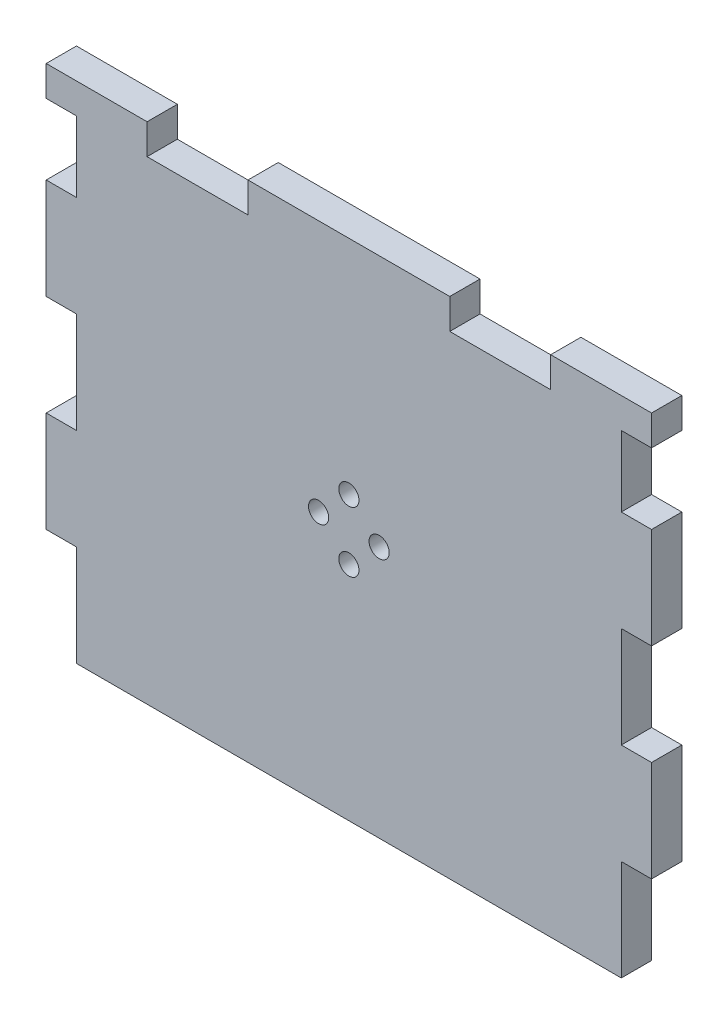
ISO-10303-21;
HEADER;
FILE_DESCRIPTION(('STEP AP214'),'2;1');
FILE_NAME('part.step','',(''),(''),'','','');
FILE_SCHEMA(('AUTOMOTIVE_DESIGN { 1 0 10303 214 1 1 1 1 }'));
ENDSEC;
DATA;
#1=APPLICATION_CONTEXT('core data for automotive mechanical design processes');
#2=APPLICATION_PROTOCOL_DEFINITION('international standard','automotive_design',2000,#1);
#3=PRODUCT_CONTEXT('',#1,'mechanical');
#4=PRODUCT('Part','Part','',(#3));
#5=PRODUCT_RELATED_PRODUCT_CATEGORY('part','',(#4));
#6=PRODUCT_DEFINITION_FORMATION('','',#4);
#7=PRODUCT_DEFINITION_CONTEXT('part definition',#1,'design');
#8=PRODUCT_DEFINITION('design','',#6,#7);
#9=PRODUCT_DEFINITION_SHAPE('','',#8);
#10=(LENGTH_UNIT() NAMED_UNIT(*) SI_UNIT(.MILLI.,.METRE.));
#11=(NAMED_UNIT(*) PLANE_ANGLE_UNIT() SI_UNIT($,.RADIAN.));
#12=(NAMED_UNIT(*) SI_UNIT($,.STERADIAN.) SOLID_ANGLE_UNIT());
#13=UNCERTAINTY_MEASURE_WITH_UNIT(LENGTH_MEASURE(1.E-05),#10,'distance_accuracy_value','');
#14=(GEOMETRIC_REPRESENTATION_CONTEXT(3) GLOBAL_UNCERTAINTY_ASSIGNED_CONTEXT((#13)) GLOBAL_UNIT_ASSIGNED_CONTEXT((#10,
#11,#12)) REPRESENTATION_CONTEXT('',''));
#15=CARTESIAN_POINT('',(0.,0.,0.));
#16=DIRECTION('',(0.,0.,1.));
#17=DIRECTION('',(1.,0.,0.));
#18=AXIS2_PLACEMENT_3D('',#15,#16,#17);
#19=CARTESIAN_POINT('',(-30.,-25.,3.));
#20=DIRECTION('',(0.,1.,0.));
#21=DIRECTION('',(0.,0.,1.));
#22=AXIS2_PLACEMENT_3D('',#19,#20,#21);
#23=PLANE('',#22);
#24=DIRECTION('',(1.,0.,0.));
#25=VECTOR('',#24,1.);
#26=CARTESIAN_POINT('',(-30.,-25.,3.));
#27=LINE('',#26,#25);
#28=CARTESIAN_POINT('',(-26.9999999999999,-25.0000000000002,2.99999999999989));
#29=VERTEX_POINT('',#28);
#30=CARTESIAN_POINT('',(27.0000000000001,-25.,2.99999999999989));
#31=VERTEX_POINT('',#30);
#32=EDGE_CURVE('E257',#29,#31,#27,.T.);
#33=ORIENTED_EDGE('',*,*,#32,.F.);
#34=DIRECTION('',(0.,0.,-1.));
#35=VECTOR('',#34,1.);
#36=CARTESIAN_POINT('',(-26.9999999999999,-25.,-47.0000000000001));
#37=LINE('',#36,#35);
#38=CARTESIAN_POINT('',(-26.9999999999999,-25.0000000000002,9.64506252643105E-13));
#39=VERTEX_POINT('',#38);
#40=EDGE_CURVE('E246',#29,#39,#37,.T.);
#41=ORIENTED_EDGE('',*,*,#40,.T.);
#42=DIRECTION('',(1.,0.,0.));
#43=VECTOR('',#42,1.);
#44=CARTESIAN_POINT('',(-30.,-25.,0.));
#45=LINE('',#44,#43);
#46=CARTESIAN_POINT('',(26.9999999999997,-25.,9.64506252643105E-13));
#47=VERTEX_POINT('',#46);
#48=EDGE_CURVE('E255',#39,#47,#45,.T.);
#49=ORIENTED_EDGE('',*,*,#48,.T.);
#50=DIRECTION('',(0.,0.,-1.));
#51=VECTOR('',#50,1.);
#52=CARTESIAN_POINT('',(27.0000000000001,-24.9999999999999,-47.0000000000001));
#53=LINE('',#52,#51);
#54=EDGE_CURVE('E372',#31,#47,#53,.T.);
#55=ORIENTED_EDGE('',*,*,#54,.F.);
#56=EDGE_LOOP('',(#33,#41,#49,#55));
#57=FACE_BOUND('',#56,.T.);
#58=ADVANCED_FACE('F37',(#57),#23,.F.);
#59=CARTESIAN_POINT('',(30.,-25.,3.));
#60=DIRECTION('',(-1.,0.,0.));
#61=DIRECTION('',(0.,0.,1.));
#62=AXIS2_PLACEMENT_3D('',#59,#60,#61);
#63=PLANE('',#62);
#64=DIRECTION('',(0.,1.,0.));
#65=VECTOR('',#64,1.);
#66=CARTESIAN_POINT('',(30.,-25.,3.));
#67=LINE('',#66,#65);
#68=CARTESIAN_POINT('',(29.9999999999999,22.,3.00000000000005));
#69=VERTEX_POINT('',#68);
#70=CARTESIAN_POINT('',(30.,25.,3.));
#71=VERTEX_POINT('',#70);
#72=EDGE_CURVE('E265',#69,#71,#67,.T.);
#73=ORIENTED_EDGE('',*,*,#72,.F.);
#74=DIRECTION('',(0.,0.,-1.));
#75=VECTOR('',#74,1.);
#76=CARTESIAN_POINT('',(29.9999999999999,22.,3.00000000000005));
#77=LINE('',#76,#75);
#78=CARTESIAN_POINT('',(29.9999999999999,22.,0.));
#79=VERTEX_POINT('',#78);
#80=EDGE_CURVE('E345',#69,#79,#77,.T.);
#81=ORIENTED_EDGE('',*,*,#80,.T.);
#82=DIRECTION('',(0.,1.,0.));
#83=VECTOR('',#82,1.);
#84=CARTESIAN_POINT('',(30.,-25.,0.));
#85=LINE('',#84,#83);
#86=CARTESIAN_POINT('',(30.,25.,0.));
#87=VERTEX_POINT('',#86);
#88=EDGE_CURVE('E406',#79,#87,#85,.T.);
#89=ORIENTED_EDGE('',*,*,#88,.T.);
#90=DIRECTION('',(0.,0.,-1.));
#91=VECTOR('',#90,1.);
#92=CARTESIAN_POINT('',(30.,25.,3.));
#93=LINE('',#92,#91);
#94=EDGE_CURVE('E280',#71,#87,#93,.T.);
#95=ORIENTED_EDGE('',*,*,#94,.F.);
#96=EDGE_LOOP('',(#73,#81,#89,#95));
#97=FACE_BOUND('',#96,.T.);
#98=ADVANCED_FACE('F491',(#97),#63,.F.);
#99=CARTESIAN_POINT('',(30.,4.99999999999999,0.));
#100=VERTEX_POINT('',#99);
#101=CARTESIAN_POINT('',(30.,15.,0.));
#102=VERTEX_POINT('',#101);
#103=EDGE_CURVE('E333',#100,#102,#85,.T.);
#104=ORIENTED_EDGE('',*,*,#103,.T.);
#105=DIRECTION('',(0.,0.,1.));
#106=VECTOR('',#105,1.);
#107=CARTESIAN_POINT('',(30.,15.,3.00000000000003));
#108=LINE('',#107,#106);
#109=CARTESIAN_POINT('',(30.,15.,3.00000000000003));
#110=VERTEX_POINT('',#109);
#111=EDGE_CURVE('E327',#102,#110,#108,.T.);
#112=ORIENTED_EDGE('',*,*,#111,.T.);
#113=CARTESIAN_POINT('',(30.,4.99999999999998,2.99999999999999));
#114=VERTEX_POINT('',#113);
#115=EDGE_CURVE('E268',#114,#110,#67,.T.);
#116=ORIENTED_EDGE('',*,*,#115,.F.);
#117=DIRECTION('',(0.,0.,-1.));
#118=VECTOR('',#117,1.);
#119=CARTESIAN_POINT('',(30.,4.99999999999998,2.99999999999999));
#120=LINE('',#119,#118);
#121=EDGE_CURVE('E348',#114,#100,#120,.T.);
#122=ORIENTED_EDGE('',*,*,#121,.T.);
#123=EDGE_LOOP('',(#104,#112,#116,#122));
#124=FACE_BOUND('',#123,.T.);
#125=ADVANCED_FACE('F465',(#124),#63,.F.);
#126=CARTESIAN_POINT('',(-30.,-25.,3.));
#127=DIRECTION('',(1.,0.,0.));
#128=DIRECTION('',(0.,0.,-1.));
#129=AXIS2_PLACEMENT_3D('',#126,#127,#128);
#130=PLANE('',#129);
#131=DIRECTION('',(0.,0.,-1.));
#132=VECTOR('',#131,1.);
#133=CARTESIAN_POINT('',(-29.9999999999999,-15.0000000000002,2.99999999999993));
#134=LINE('',#133,#132);
#135=CARTESIAN_POINT('',(-29.9999999999999,-15.0000000000002,2.99999999999993));
#136=VERTEX_POINT('',#135);
#137=CARTESIAN_POINT('',(-29.9999999999999,-15.0000000000002,0.));
#138=VERTEX_POINT('',#137);
#139=EDGE_CURVE('E512',#136,#138,#134,.T.);
#140=ORIENTED_EDGE('',*,*,#139,.F.);
#141=DIRECTION('',(0.,-1.,0.));
#142=VECTOR('',#141,1.);
#143=CARTESIAN_POINT('',(-30.,-25.,3.));
#144=LINE('',#143,#142);
#145=CARTESIAN_POINT('',(-30.,-5.00000000000023,2.99999999999996));
#146=VERTEX_POINT('',#145);
#147=EDGE_CURVE('E440',#146,#136,#144,.T.);
#148=ORIENTED_EDGE('',*,*,#147,.F.);
#149=DIRECTION('',(0.,0.,1.));
#150=VECTOR('',#149,1.);
#151=CARTESIAN_POINT('',(-30.,-5.00000000000023,2.99999999999996));
#152=LINE('',#151,#150);
#153=CARTESIAN_POINT('',(-30.,-5.00000000000022,0.));
#154=VERTEX_POINT('',#153);
#155=EDGE_CURVE('E503',#154,#146,#152,.T.);
#156=ORIENTED_EDGE('',*,*,#155,.F.);
#157=DIRECTION('',(0.,-1.,0.));
#158=VECTOR('',#157,1.);
#159=CARTESIAN_POINT('',(-30.,-25.,0.));
#160=LINE('',#159,#158);
#161=EDGE_CURVE('E274',#154,#138,#160,.T.);
#162=ORIENTED_EDGE('',*,*,#161,.T.);
#163=EDGE_LOOP('',(#140,#148,#156,#162));
#164=FACE_BOUND('',#163,.T.);
#165=ADVANCED_FACE('F571',(#164),#130,.F.);
#166=DIRECTION('',(0.,0.,-1.));
#167=VECTOR('',#166,1.);
#168=CARTESIAN_POINT('',(-30.,4.99999999999977,2.99999999999999));
#169=LINE('',#168,#167);
#170=CARTESIAN_POINT('',(-30.,4.99999999999977,2.99999999999999));
#171=VERTEX_POINT('',#170);
#172=CARTESIAN_POINT('',(-30.,4.99999999999978,0.));
#173=VERTEX_POINT('',#172);
#174=EDGE_CURVE('E516',#171,#173,#169,.T.);
#175=ORIENTED_EDGE('',*,*,#174,.F.);
#176=CARTESIAN_POINT('',(-30.,14.9999999999998,3.00000000000003));
#177=VERTEX_POINT('',#176);
#178=EDGE_CURVE('E446',#177,#171,#144,.T.);
#179=ORIENTED_EDGE('',*,*,#178,.F.);
#180=DIRECTION('',(0.,0.,1.));
#181=VECTOR('',#180,1.);
#182=CARTESIAN_POINT('',(-30.,14.9999999999998,3.00000000000003));
#183=LINE('',#182,#181);
#184=CARTESIAN_POINT('',(-30.,14.9999999999998,0.));
#185=VERTEX_POINT('',#184);
#186=EDGE_CURVE('E519',#185,#177,#183,.T.);
#187=ORIENTED_EDGE('',*,*,#186,.F.);
#188=EDGE_CURVE('E272',#185,#173,#160,.T.);
#189=ORIENTED_EDGE('',*,*,#188,.T.);
#190=EDGE_LOOP('',(#175,#179,#187,#189));
#191=FACE_BOUND('',#190,.T.);
#192=ADVANCED_FACE('F588',(#191),#130,.F.);
#193=DIRECTION('',(0.,0.,-1.));
#194=VECTOR('',#193,1.);
#195=CARTESIAN_POINT('',(-30.,21.9999999999998,3.00000000000005));
#196=LINE('',#195,#194);
#197=CARTESIAN_POINT('',(-30.,21.9999999999998,3.00000000000005));
#198=VERTEX_POINT('',#197);
#199=CARTESIAN_POINT('',(-30.,21.9999999999998,0.));
#200=VERTEX_POINT('',#199);
#201=EDGE_CURVE('E535',#198,#200,#196,.T.);
#202=ORIENTED_EDGE('',*,*,#201,.F.);
#203=CARTESIAN_POINT('',(-30.,25.,3.));
#204=VERTEX_POINT('',#203);
#205=EDGE_CURVE('E443',#204,#198,#144,.T.);
#206=ORIENTED_EDGE('',*,*,#205,.F.);
#207=DIRECTION('',(0.,0.,-1.));
#208=VECTOR('',#207,1.);
#209=CARTESIAN_POINT('',(-30.,25.,3.));
#210=LINE('',#209,#208);
#211=CARTESIAN_POINT('',(-30.,25.,0.));
#212=VERTEX_POINT('',#211);
#213=EDGE_CURVE('E277',#204,#212,#210,.T.);
#214=ORIENTED_EDGE('',*,*,#213,.T.);
#215=EDGE_CURVE('E266',#212,#200,#160,.T.);
#216=ORIENTED_EDGE('',*,*,#215,.T.);
#217=EDGE_LOOP('',(#202,#206,#214,#216));
#218=FACE_BOUND('',#217,.T.);
#219=ADVANCED_FACE('F548',(#218),#130,.F.);
#220=CARTESIAN_POINT('',(0.,0.,0.));
#221=DIRECTION('',(0.,0.,-1.));
#222=DIRECTION('',(-1.,0.,0.));
#223=AXIS2_PLACEMENT_3D('',#220,#221,#222);
#224=PLANE('',#223);
#225=CARTESIAN_POINT('',(0.,3.,0.));
#226=DIRECTION('',(0.,0.,-1.));
#227=DIRECTION('',(-1.,0.,0.));
#228=AXIS2_PLACEMENT_3D('',#225,#226,#227);
#229=CIRCLE('',#228,1.);
#230=CARTESIAN_POINT('',(-1.,3.,0.));
#231=VERTEX_POINT('',#230);
#232=EDGE_CURVE('E294',#231,#231,#229,.T.);
#233=ORIENTED_EDGE('',*,*,#232,.F.);
#234=EDGE_LOOP('',(#233));
#235=FACE_BOUND('',#234,.T.);
#236=CARTESIAN_POINT('',(3.00000000000008,0.,0.));
#237=DIRECTION('',(0.,0.,-1.));
#238=DIRECTION('',(-1.,0.,0.));
#239=AXIS2_PLACEMENT_3D('',#236,#237,#238);
#240=CIRCLE('',#239,1.00000000000007);
#241=CARTESIAN_POINT('',(2.00000000000002,0.,0.));
#242=VERTEX_POINT('',#241);
#243=EDGE_CURVE('E291',#242,#242,#240,.T.);
#244=ORIENTED_EDGE('',*,*,#243,.F.);
#245=EDGE_LOOP('',(#244));
#246=FACE_BOUND('',#245,.T.);
#247=CARTESIAN_POINT('',(1.69428074463191E-13,-3.,0.));
#248=DIRECTION('',(0.,0.,-1.));
#249=DIRECTION('',(-1.,0.,0.));
#250=AXIS2_PLACEMENT_3D('',#247,#248,#249);
#251=CIRCLE('',#250,1.00000000000018);
#252=CARTESIAN_POINT('',(-1.00000000000001,-3.,0.));
#253=VERTEX_POINT('',#252);
#254=EDGE_CURVE('E287',#253,#253,#251,.T.);
#255=ORIENTED_EDGE('',*,*,#254,.F.);
#256=EDGE_LOOP('',(#255));
#257=FACE_BOUND('',#256,.T.);
#258=CARTESIAN_POINT('',(-2.99999999999992,0.,0.));
#259=DIRECTION('',(0.,0.,-1.));
#260=DIRECTION('',(-1.,0.,0.));
#261=AXIS2_PLACEMENT_3D('',#258,#259,#260);
#262=CIRCLE('',#261,1.00000000000014);
#263=CARTESIAN_POINT('',(-4.00000000000005,0.,0.));
#264=VERTEX_POINT('',#263);
#265=EDGE_CURVE('E284',#264,#264,#262,.T.);
#266=ORIENTED_EDGE('',*,*,#265,.F.);
#267=EDGE_LOOP('',(#266));
#268=FACE_BOUND('',#267,.T.);
#269=ORIENTED_EDGE('',*,*,#48,.F.);
#270=DIRECTION('',(0.,1.,0.));
#271=VECTOR('',#270,1.);
#272=CARTESIAN_POINT('',(-27.,0.,0.));
#273=LINE('',#272,#271);
#274=CARTESIAN_POINT('',(-26.9999999999999,-15.0000000000002,0.));
#275=VERTEX_POINT('',#274);
#276=EDGE_CURVE('E11',#39,#275,#273,.T.);
#277=ORIENTED_EDGE('',*,*,#276,.T.);
#278=DIRECTION('',(1.,0.,0.));
#279=VECTOR('',#278,1.);
#280=CARTESIAN_POINT('',(-29.9999999999999,-15.0000000000002,0.));
#281=LINE('',#280,#279);
#282=EDGE_CURVE('E500',#138,#275,#281,.T.);
#283=ORIENTED_EDGE('',*,*,#282,.F.);
#284=ORIENTED_EDGE('',*,*,#161,.F.);
#285=DIRECTION('',(1.,0.,0.));
#286=VECTOR('',#285,1.);
#287=CARTESIAN_POINT('',(-30.,-5.00000000000022,0.));
#288=LINE('',#287,#286);
#289=CARTESIAN_POINT('',(-27.,-5.00000000000021,0.));
#290=VERTEX_POINT('',#289);
#291=EDGE_CURVE('E502',#154,#290,#288,.T.);
#292=ORIENTED_EDGE('',*,*,#291,.T.);
#293=CARTESIAN_POINT('',(-27.,4.99999999999979,0.));
#294=VERTEX_POINT('',#293);
#295=EDGE_CURVE('E46',#290,#294,#273,.T.);
#296=ORIENTED_EDGE('',*,*,#295,.T.);
#297=DIRECTION('',(1.,0.,0.));
#298=VECTOR('',#297,1.);
#299=CARTESIAN_POINT('',(-30.,4.99999999999978,0.));
#300=LINE('',#299,#298);
#301=EDGE_CURVE('E521',#173,#294,#300,.T.);
#302=ORIENTED_EDGE('',*,*,#301,.F.);
#303=ORIENTED_EDGE('',*,*,#188,.F.);
#304=DIRECTION('',(1.,0.,0.));
#305=VECTOR('',#304,1.);
#306=CARTESIAN_POINT('',(-30.,14.9999999999998,0.));
#307=LINE('',#306,#305);
#308=CARTESIAN_POINT('',(-27.,14.9999999999998,0.));
#309=VERTEX_POINT('',#308);
#310=EDGE_CURVE('E531',#185,#309,#307,.T.);
#311=ORIENTED_EDGE('',*,*,#310,.T.);
#312=CARTESIAN_POINT('',(-27.,21.9999999999998,0.));
#313=VERTEX_POINT('',#312);
#314=EDGE_CURVE('E41',#309,#313,#273,.T.);
#315=ORIENTED_EDGE('',*,*,#314,.T.);
#316=DIRECTION('',(-1.,0.,0.));
#317=VECTOR('',#316,1.);
#318=CARTESIAN_POINT('',(0.,21.9999999999999,0.));
#319=LINE('',#318,#317);
#320=EDGE_CURVE('E303',#313,#200,#319,.T.);
#321=ORIENTED_EDGE('',*,*,#320,.T.);
#322=ORIENTED_EDGE('',*,*,#215,.F.);
#323=DIRECTION('',(-1.,0.,0.));
#324=VECTOR('',#323,1.);
#325=CARTESIAN_POINT('',(-30.,25.,0.));
#326=LINE('',#325,#324);
#327=CARTESIAN_POINT('',(-20.,25.,0.));
#328=VERTEX_POINT('',#327);
#329=EDGE_CURVE('E452',#328,#212,#326,.T.);
#330=ORIENTED_EDGE('',*,*,#329,.F.);
#331=DIRECTION('',(0.,-1.,0.));
#332=VECTOR('',#331,1.);
#333=CARTESIAN_POINT('',(-20.,25.,0.));
#334=LINE('',#333,#332);
#335=CARTESIAN_POINT('',(-20.,22.,0.));
#336=VERTEX_POINT('',#335);
#337=EDGE_CURVE('E385',#328,#336,#334,.T.);
#338=ORIENTED_EDGE('',*,*,#337,.T.);
#339=DIRECTION('',(1.,0.,0.));
#340=VECTOR('',#339,1.);
#341=CARTESIAN_POINT('',(-20.,22.,0.));
#342=LINE('',#341,#340);
#343=CARTESIAN_POINT('',(-10.,22.,0.));
#344=VERTEX_POINT('',#343);
#345=EDGE_CURVE('E388',#336,#344,#342,.T.);
#346=ORIENTED_EDGE('',*,*,#345,.T.);
#347=DIRECTION('',(0.,1.,0.));
#348=VECTOR('',#347,1.);
#349=CARTESIAN_POINT('',(-10.,25.,0.));
#350=LINE('',#349,#348);
#351=CARTESIAN_POINT('',(-10.,25.,0.));
#352=VERTEX_POINT('',#351);
#353=EDGE_CURVE('E392',#344,#352,#350,.T.);
#354=ORIENTED_EDGE('',*,*,#353,.T.);
#355=CARTESIAN_POINT('',(9.99999999999999,25.,0.));
#356=VERTEX_POINT('',#355);
#357=EDGE_CURVE('E451',#356,#352,#326,.T.);
#358=ORIENTED_EDGE('',*,*,#357,.F.);
#359=DIRECTION('',(0.,-1.,0.));
#360=VECTOR('',#359,1.);
#361=CARTESIAN_POINT('',(9.99999999999999,25.,0.));
#362=LINE('',#361,#360);
#363=CARTESIAN_POINT('',(10.,22.,0.));
#364=VERTEX_POINT('',#363);
#365=EDGE_CURVE('E425',#356,#364,#362,.T.);
#366=ORIENTED_EDGE('',*,*,#365,.T.);
#367=DIRECTION('',(1.,0.,0.));
#368=VECTOR('',#367,1.);
#369=CARTESIAN_POINT('',(10.,22.,0.));
#370=LINE('',#369,#368);
#371=CARTESIAN_POINT('',(20.,22.,0.));
#372=VERTEX_POINT('',#371);
#373=EDGE_CURVE('E432',#364,#372,#370,.T.);
#374=ORIENTED_EDGE('',*,*,#373,.T.);
#375=DIRECTION('',(0.,1.,0.));
#376=VECTOR('',#375,1.);
#377=CARTESIAN_POINT('',(20.,25.,0.));
#378=LINE('',#377,#376);
#379=CARTESIAN_POINT('',(20.,25.,0.));
#380=VERTEX_POINT('',#379);
#381=EDGE_CURVE('E415',#372,#380,#378,.T.);
#382=ORIENTED_EDGE('',*,*,#381,.T.);
#383=EDGE_CURVE('E449',#87,#380,#326,.T.);
#384=ORIENTED_EDGE('',*,*,#383,.F.);
#385=ORIENTED_EDGE('',*,*,#88,.F.);
#386=DIRECTION('',(-1.,0.,0.));
#387=VECTOR('',#386,1.);
#388=CARTESIAN_POINT('',(0.,21.9999999999999,0.));
#389=LINE('',#388,#387);
#390=CARTESIAN_POINT('',(26.9999999999999,22.,0.));
#391=VERTEX_POINT('',#390);
#392=EDGE_CURVE('E283',#79,#391,#389,.T.);
#393=ORIENTED_EDGE('',*,*,#392,.T.);
#394=DIRECTION('',(0.,1.,0.));
#395=VECTOR('',#394,1.);
#396=CARTESIAN_POINT('',(27.,0.,0.));
#397=LINE('',#396,#395);
#398=CARTESIAN_POINT('',(27.,15.,0.));
#399=VERTEX_POINT('',#398);
#400=EDGE_CURVE('E300',#399,#391,#397,.T.);
#401=ORIENTED_EDGE('',*,*,#400,.F.);
#402=DIRECTION('',(1.,0.,0.));
#403=VECTOR('',#402,1.);
#404=CARTESIAN_POINT('',(27.,15.,0.));
#405=LINE('',#404,#403);
#406=EDGE_CURVE('E334',#399,#102,#405,.T.);
#407=ORIENTED_EDGE('',*,*,#406,.T.);
#408=ORIENTED_EDGE('',*,*,#103,.F.);
#409=DIRECTION('',(1.,0.,0.));
#410=VECTOR('',#409,1.);
#411=CARTESIAN_POINT('',(27.,4.99999999999998,0.));
#412=LINE('',#411,#410);
#413=CARTESIAN_POINT('',(27.,4.99999999999998,0.));
#414=VERTEX_POINT('',#413);
#415=EDGE_CURVE('E322',#414,#100,#412,.T.);
#416=ORIENTED_EDGE('',*,*,#415,.F.);
#417=CARTESIAN_POINT('',(27.,-5.00000000000002,0.));
#418=VERTEX_POINT('',#417);
#419=EDGE_CURVE('E302',#418,#414,#397,.T.);
#420=ORIENTED_EDGE('',*,*,#419,.F.);
#421=DIRECTION('',(1.,0.,0.));
#422=VECTOR('',#421,1.);
#423=CARTESIAN_POINT('',(27.,-5.00000000000002,0.));
#424=LINE('',#423,#422);
#425=CARTESIAN_POINT('',(30.,-5.00000000000001,0.));
#426=VERTEX_POINT('',#425);
#427=EDGE_CURVE('E366',#418,#426,#424,.T.);
#428=ORIENTED_EDGE('',*,*,#427,.T.);
#429=CARTESIAN_POINT('',(30.0000000000001,-15.,0.));
#430=VERTEX_POINT('',#429);
#431=EDGE_CURVE('E448',#430,#426,#85,.T.);
#432=ORIENTED_EDGE('',*,*,#431,.F.);
#433=DIRECTION('',(1.,0.,0.));
#434=VECTOR('',#433,1.);
#435=CARTESIAN_POINT('',(27.0000000000001,-15.,0.));
#436=LINE('',#435,#434);
#437=CARTESIAN_POINT('',(27.0000000000001,-15.,0.));
#438=VERTEX_POINT('',#437);
#439=EDGE_CURVE('E355',#438,#430,#436,.T.);
#440=ORIENTED_EDGE('',*,*,#439,.F.);
#441=EDGE_CURVE('E263',#47,#438,#397,.T.);
#442=ORIENTED_EDGE('',*,*,#441,.F.);
#443=EDGE_LOOP('',(#269,#277,#283,#284,#292,#296,#302,#303,#311,#315,#321,#322,#330,#338,#346,
#354,#358,#366,#374,#382,#384,#385,#393,#401,#407,#408,#416,#420,#428,#432,#440,#442));
#444=FACE_BOUND('',#443,.T.);
#445=ADVANCED_FACE('F261',(#235,#246,#257,#268,#444),#224,.T.);
#446=CARTESIAN_POINT('',(-30.,25.,3.));
#447=DIRECTION('',(0.,-1.,0.));
#448=DIRECTION('',(0.,0.,-1.));
#449=AXIS2_PLACEMENT_3D('',#446,#447,#448);
#450=PLANE('',#449);
#451=DIRECTION('',(-1.,0.,0.));
#452=VECTOR('',#451,1.);
#453=CARTESIAN_POINT('',(-30.,25.,3.));
#454=LINE('',#453,#452);
#455=CARTESIAN_POINT('',(-20.,25.,3.));
#456=VERTEX_POINT('',#455);
#457=EDGE_CURVE('E442',#456,#204,#454,.T.);
#458=ORIENTED_EDGE('',*,*,#457,.F.);
#459=DIRECTION('',(0.,0.,1.));
#460=VECTOR('',#459,1.);
#461=CARTESIAN_POINT('',(-20.,25.,0.));
#462=LINE('',#461,#460);
#463=EDGE_CURVE('E404',#328,#456,#462,.T.);
#464=ORIENTED_EDGE('',*,*,#463,.F.);
#465=ORIENTED_EDGE('',*,*,#329,.T.);
#466=ORIENTED_EDGE('',*,*,#213,.F.);
#467=EDGE_LOOP('',(#458,#464,#465,#466));
#468=FACE_BOUND('',#467,.T.);
#469=ADVANCED_FACE('F554',(#468),#450,.F.);
#470=ORIENTED_EDGE('',*,*,#357,.T.);
#471=DIRECTION('',(0.,0.,1.));
#472=VECTOR('',#471,1.);
#473=CARTESIAN_POINT('',(-10.,25.,0.));
#474=LINE('',#473,#472);
#475=CARTESIAN_POINT('',(-10.,25.,3.));
#476=VERTEX_POINT('',#475);
#477=EDGE_CURVE('E407',#352,#476,#474,.T.);
#478=ORIENTED_EDGE('',*,*,#477,.T.);
#479=CARTESIAN_POINT('',(9.99999999999999,25.,3.));
#480=VERTEX_POINT('',#479);
#481=EDGE_CURVE('E441',#480,#476,#454,.T.);
#482=ORIENTED_EDGE('',*,*,#481,.F.);
#483=DIRECTION('',(0.,0.,1.));
#484=VECTOR('',#483,1.);
#485=CARTESIAN_POINT('',(9.99999999999999,25.,0.));
#486=LINE('',#485,#484);
#487=EDGE_CURVE('E297',#356,#480,#486,.T.);
#488=ORIENTED_EDGE('',*,*,#487,.F.);
#489=EDGE_LOOP('',(#470,#478,#482,#488));
#490=FACE_BOUND('',#489,.T.);
#491=ADVANCED_FACE('F620',(#490),#450,.F.);
#492=ORIENTED_EDGE('',*,*,#431,.T.);
#493=DIRECTION('',(0.,0.,1.));
#494=VECTOR('',#493,1.);
#495=CARTESIAN_POINT('',(30.,-5.00000000000002,2.99999999999996));
#496=LINE('',#495,#494);
#497=CARTESIAN_POINT('',(30.,-5.00000000000002,2.99999999999996));
#498=VERTEX_POINT('',#497);
#499=EDGE_CURVE('E353',#426,#498,#496,.T.);
#500=ORIENTED_EDGE('',*,*,#499,.T.);
#501=CARTESIAN_POINT('',(30.0000000000001,-15.,2.99999999999993));
#502=VERTEX_POINT('',#501);
#503=EDGE_CURVE('E270',#502,#498,#67,.T.);
#504=ORIENTED_EDGE('',*,*,#503,.F.);
#505=DIRECTION('',(0.,0.,-1.));
#506=VECTOR('',#505,1.);
#507=CARTESIAN_POINT('',(30.0000000000001,-15.,2.99999999999993));
#508=LINE('',#507,#506);
#509=EDGE_CURVE('E349',#502,#430,#508,.T.);
#510=ORIENTED_EDGE('',*,*,#509,.T.);
#511=EDGE_LOOP('',(#492,#500,#504,#510));
#512=FACE_BOUND('',#511,.T.);
#513=ADVANCED_FACE('F39',(#512),#63,.F.);
#514=ORIENTED_EDGE('',*,*,#383,.T.);
#515=DIRECTION('',(0.,0.,1.));
#516=VECTOR('',#515,1.);
#517=CARTESIAN_POINT('',(20.,25.,0.));
#518=LINE('',#517,#516);
#519=CARTESIAN_POINT('',(20.,25.,3.));
#520=VERTEX_POINT('',#519);
#521=EDGE_CURVE('E418',#380,#520,#518,.T.);
#522=ORIENTED_EDGE('',*,*,#521,.T.);
#523=EDGE_CURVE('E437',#71,#520,#454,.T.);
#524=ORIENTED_EDGE('',*,*,#523,.F.);
#525=ORIENTED_EDGE('',*,*,#94,.T.);
#526=EDGE_LOOP('',(#514,#522,#524,#525));
#527=FACE_BOUND('',#526,.T.);
#528=ADVANCED_FACE('F618',(#527),#450,.F.);
#529=CARTESIAN_POINT('',(0.,0.,3.));
#530=DIRECTION('',(0.,0.,-1.));
#531=DIRECTION('',(-1.,0.,0.));
#532=AXIS2_PLACEMENT_3D('',#529,#530,#531);
#533=PLANE('',#532);
#534=DIRECTION('',(1.,0.,0.));
#535=VECTOR('',#534,1.);
#536=CARTESIAN_POINT('',(-29.9999999999999,-15.0000000000002,2.99999999999993));
#537=LINE('',#536,#535);
#538=CARTESIAN_POINT('',(-26.9999999999999,-15.0000000000002,2.99999999999993));
#539=VERTEX_POINT('',#538);
#540=EDGE_CURVE('E499',#136,#539,#537,.T.);
#541=ORIENTED_EDGE('',*,*,#540,.T.);
#542=DIRECTION('',(0.,-1.,0.));
#543=VECTOR('',#542,1.);
#544=CARTESIAN_POINT('',(-26.9999999999999,-25.0000000000002,2.99999999999989));
#545=LINE('',#544,#543);
#546=EDGE_CURVE('E496',#539,#29,#545,.T.);
#547=ORIENTED_EDGE('',*,*,#546,.T.);
#548=ORIENTED_EDGE('',*,*,#32,.T.);
#549=DIRECTION('',(0.,-1.,0.));
#550=VECTOR('',#549,1.);
#551=CARTESIAN_POINT('',(27.0000000000001,-25.,2.99999999999989));
#552=LINE('',#551,#550);
#553=CARTESIAN_POINT('',(27.0000000000001,-15.,2.99999999999993));
#554=VERTEX_POINT('',#553);
#555=EDGE_CURVE('E363',#554,#31,#552,.T.);
#556=ORIENTED_EDGE('',*,*,#555,.F.);
#557=DIRECTION('',(1.,0.,0.));
#558=VECTOR('',#557,1.);
#559=CARTESIAN_POINT('',(27.0000000000001,-15.,2.99999999999993));
#560=LINE('',#559,#558);
#561=EDGE_CURVE('E360',#554,#502,#560,.T.);
#562=ORIENTED_EDGE('',*,*,#561,.T.);
#563=ORIENTED_EDGE('',*,*,#503,.T.);
#564=DIRECTION('',(1.,0.,0.));
#565=VECTOR('',#564,1.);
#566=CARTESIAN_POINT('',(27.,-5.00000000000003,2.99999999999996));
#567=LINE('',#566,#565);
#568=CARTESIAN_POINT('',(27.,-5.00000000000003,2.99999999999996));
#569=VERTEX_POINT('',#568);
#570=EDGE_CURVE('E364',#569,#498,#567,.T.);
#571=ORIENTED_EDGE('',*,*,#570,.F.);
#572=CARTESIAN_POINT('',(27.,4.99999999999997,2.99999999999999));
#573=VERTEX_POINT('',#572);
#574=EDGE_CURVE('E370',#573,#569,#552,.T.);
#575=ORIENTED_EDGE('',*,*,#574,.F.);
#576=DIRECTION('',(1.,0.,0.));
#577=VECTOR('',#576,1.);
#578=CARTESIAN_POINT('',(27.,4.99999999999997,2.99999999999999));
#579=LINE('',#578,#577);
#580=EDGE_CURVE('E325',#573,#114,#579,.T.);
#581=ORIENTED_EDGE('',*,*,#580,.T.);
#582=ORIENTED_EDGE('',*,*,#115,.T.);
#583=DIRECTION('',(1.,0.,0.));
#584=VECTOR('',#583,1.);
#585=CARTESIAN_POINT('',(27.,15.,3.00000000000003));
#586=LINE('',#585,#584);
#587=CARTESIAN_POINT('',(27.,15.,3.00000000000003));
#588=VERTEX_POINT('',#587);
#589=EDGE_CURVE('E337',#588,#110,#586,.T.);
#590=ORIENTED_EDGE('',*,*,#589,.F.);
#591=CARTESIAN_POINT('',(26.9999999999999,22.,3.00000000000005));
#592=VERTEX_POINT('',#591);
#593=EDGE_CURVE('E371',#592,#588,#552,.T.);
#594=ORIENTED_EDGE('',*,*,#593,.F.);
#595=DIRECTION('',(1.,0.,0.));
#596=VECTOR('',#595,1.);
#597=CARTESIAN_POINT('',(26.9999999999999,22.,3.00000000000005));
#598=LINE('',#597,#596);
#599=EDGE_CURVE('E493',#592,#69,#598,.T.);
#600=ORIENTED_EDGE('',*,*,#599,.T.);
#601=ORIENTED_EDGE('',*,*,#72,.T.);
#602=ORIENTED_EDGE('',*,*,#523,.T.);
#603=DIRECTION('',(0.,1.,0.));
#604=VECTOR('',#603,1.);
#605=CARTESIAN_POINT('',(20.,25.,3.));
#606=LINE('',#605,#604);
#607=CARTESIAN_POINT('',(20.,22.,3.));
#608=VERTEX_POINT('',#607);
#609=EDGE_CURVE('E422',#608,#520,#606,.T.);
#610=ORIENTED_EDGE('',*,*,#609,.F.);
#611=DIRECTION('',(1.,0.,0.));
#612=VECTOR('',#611,1.);
#613=CARTESIAN_POINT('',(10.,22.,3.));
#614=LINE('',#613,#612);
#615=CARTESIAN_POINT('',(10.,22.,3.));
#616=VERTEX_POINT('',#615);
#617=EDGE_CURVE('E424',#616,#608,#614,.T.);
#618=ORIENTED_EDGE('',*,*,#617,.F.);
#619=DIRECTION('',(0.,-1.,0.));
#620=VECTOR('',#619,1.);
#621=CARTESIAN_POINT('',(9.99999999999999,25.,3.));
#622=LINE('',#621,#620);
#623=EDGE_CURVE('E400',#480,#616,#622,.T.);
#624=ORIENTED_EDGE('',*,*,#623,.F.);
#625=ORIENTED_EDGE('',*,*,#481,.T.);
#626=DIRECTION('',(0.,1.,0.));
#627=VECTOR('',#626,1.);
#628=CARTESIAN_POINT('',(-10.,25.,3.));
#629=LINE('',#628,#627);
#630=CARTESIAN_POINT('',(-10.,22.,3.));
#631=VERTEX_POINT('',#630);
#632=EDGE_CURVE('E389',#631,#476,#629,.T.);
#633=ORIENTED_EDGE('',*,*,#632,.F.);
#634=DIRECTION('',(1.,0.,0.));
#635=VECTOR('',#634,1.);
#636=CARTESIAN_POINT('',(-20.,22.,3.));
#637=LINE('',#636,#635);
#638=CARTESIAN_POINT('',(-20.,22.,3.));
#639=VERTEX_POINT('',#638);
#640=EDGE_CURVE('E399',#639,#631,#637,.T.);
#641=ORIENTED_EDGE('',*,*,#640,.F.);
#642=DIRECTION('',(0.,-1.,0.));
#643=VECTOR('',#642,1.);
#644=CARTESIAN_POINT('',(-20.,25.,3.));
#645=LINE('',#644,#643);
#646=EDGE_CURVE('E396',#456,#639,#645,.T.);
#647=ORIENTED_EDGE('',*,*,#646,.F.);
#648=ORIENTED_EDGE('',*,*,#457,.T.);
#649=ORIENTED_EDGE('',*,*,#205,.T.);
#650=DIRECTION('',(1.,0.,0.));
#651=VECTOR('',#650,1.);
#652=CARTESIAN_POINT('',(-30.,21.9999999999998,3.00000000000005));
#653=LINE('',#652,#651);
#654=CARTESIAN_POINT('',(-27.,21.9999999999998,3.00000000000005));
#655=VERTEX_POINT('',#654);
#656=EDGE_CURVE('E374',#198,#655,#653,.T.);
#657=ORIENTED_EDGE('',*,*,#656,.T.);
#658=CARTESIAN_POINT('',(-27.,14.9999999999998,3.00000000000003));
#659=VERTEX_POINT('',#658);
#660=EDGE_CURVE('E259',#655,#659,#545,.T.);
#661=ORIENTED_EDGE('',*,*,#660,.T.);
#662=DIRECTION('',(1.,0.,0.));
#663=VECTOR('',#662,1.);
#664=CARTESIAN_POINT('',(-30.,14.9999999999998,3.00000000000003));
#665=LINE('',#664,#663);
#666=EDGE_CURVE('E527',#177,#659,#665,.T.);
#667=ORIENTED_EDGE('',*,*,#666,.F.);
#668=ORIENTED_EDGE('',*,*,#178,.T.);
#669=DIRECTION('',(1.,0.,0.));
#670=VECTOR('',#669,1.);
#671=CARTESIAN_POINT('',(-30.,4.99999999999977,2.99999999999999));
#672=LINE('',#671,#670);
#673=CARTESIAN_POINT('',(-27.,4.99999999999978,2.99999999999999));
#674=VERTEX_POINT('',#673);
#675=EDGE_CURVE('E524',#171,#674,#672,.T.);
#676=ORIENTED_EDGE('',*,*,#675,.T.);
#677=CARTESIAN_POINT('',(-27.,-5.00000000000022,2.99999999999996));
#678=VERTEX_POINT('',#677);
#679=EDGE_CURVE('E498',#674,#678,#545,.T.);
#680=ORIENTED_EDGE('',*,*,#679,.T.);
#681=DIRECTION('',(1.,0.,0.));
#682=VECTOR('',#681,1.);
#683=CARTESIAN_POINT('',(-30.,-5.00000000000023,2.99999999999996));
#684=LINE('',#683,#682);
#685=EDGE_CURVE('E506',#146,#678,#684,.T.);
#686=ORIENTED_EDGE('',*,*,#685,.F.);
#687=ORIENTED_EDGE('',*,*,#147,.T.);
#688=EDGE_LOOP('',(#541,#547,#548,#556,#562,#563,#571,#575,#581,#582,#590,#594,#600,#601,#602,
#610,#618,#624,#625,#633,#641,#647,#648,#649,#657,#661,#667,#668,#676,#680,#686,#687));
#689=FACE_BOUND('',#688,.T.);
#690=CARTESIAN_POINT('',(0.,3.,3.));
#691=DIRECTION('',(0.,0.,1.));
#692=DIRECTION('',(1.,0.,0.));
#693=AXIS2_PLACEMENT_3D('',#690,#691,#692);
#694=CIRCLE('',#693,1.);
#695=CARTESIAN_POINT('',(1.,3.,3.));
#696=VERTEX_POINT('',#695);
#697=EDGE_CURVE('E288',#696,#696,#694,.T.);
#698=ORIENTED_EDGE('',*,*,#697,.F.);
#699=EDGE_LOOP('',(#698));
#700=FACE_BOUND('',#699,.T.);
#701=CARTESIAN_POINT('',(3.00000000000008,0.,3.));
#702=DIRECTION('',(0.,0.,1.));
#703=DIRECTION('',(1.,0.,0.));
#704=AXIS2_PLACEMENT_3D('',#701,#702,#703);
#705=CIRCLE('',#704,1.00000000000007);
#706=CARTESIAN_POINT('',(4.00000000000015,0.,3.));
#707=VERTEX_POINT('',#706);
#708=EDGE_CURVE('E377',#707,#707,#705,.T.);
#709=ORIENTED_EDGE('',*,*,#708,.F.);
#710=EDGE_LOOP('',(#709));
#711=FACE_BOUND('',#710,.T.);
#712=CARTESIAN_POINT('',(1.69428074463191E-13,-3.,3.));
#713=DIRECTION('',(0.,0.,1.));
#714=DIRECTION('',(1.,0.,0.));
#715=AXIS2_PLACEMENT_3D('',#712,#713,#714);
#716=CIRCLE('',#715,1.00000000000018);
#717=CARTESIAN_POINT('',(1.00000000000035,-3.,3.));
#718=VERTEX_POINT('',#717);
#719=EDGE_CURVE('E380',#718,#718,#716,.T.);
#720=ORIENTED_EDGE('',*,*,#719,.F.);
#721=EDGE_LOOP('',(#720));
#722=FACE_BOUND('',#721,.T.);
#723=CARTESIAN_POINT('',(-2.99999999999992,0.,3.));
#724=DIRECTION('',(0.,0.,1.));
#725=DIRECTION('',(1.,0.,0.));
#726=AXIS2_PLACEMENT_3D('',#723,#724,#725);
#727=CIRCLE('',#726,1.00000000000014);
#728=CARTESIAN_POINT('',(-1.99999999999978,0.,3.));
#729=VERTEX_POINT('',#728);
#730=EDGE_CURVE('E258',#729,#729,#727,.T.);
#731=ORIENTED_EDGE('',*,*,#730,.F.);
#732=EDGE_LOOP('',(#731));
#733=FACE_BOUND('',#732,.T.);
#734=ADVANCED_FACE('F470',(#689,#700,#711,#722,#733),#533,.F.);
#735=CARTESIAN_POINT('',(9.99999999999999,25.,0.));
#736=DIRECTION('',(-1.,0.,0.));
#737=DIRECTION('',(0.,-1.,0.));
#738=AXIS2_PLACEMENT_3D('',#735,#736,#737);
#739=PLANE('',#738);
#740=ORIENTED_EDGE('',*,*,#623,.T.);
#741=DIRECTION('',(0.,0.,1.));
#742=VECTOR('',#741,1.);
#743=CARTESIAN_POINT('',(10.,22.,0.));
#744=LINE('',#743,#742);
#745=EDGE_CURVE('E413',#364,#616,#744,.T.);
#746=ORIENTED_EDGE('',*,*,#745,.F.);
#747=ORIENTED_EDGE('',*,*,#365,.F.);
#748=ORIENTED_EDGE('',*,*,#487,.T.);
#749=EDGE_LOOP('',(#740,#746,#747,#748));
#750=FACE_BOUND('',#749,.T.);
#751=ADVANCED_FACE('F625',(#750),#739,.F.);
#752=CARTESIAN_POINT('',(20.,25.,0.));
#753=DIRECTION('',(1.,0.,0.));
#754=DIRECTION('',(0.,0.,-1.));
#755=AXIS2_PLACEMENT_3D('',#752,#753,#754);
#756=PLANE('',#755);
#757=ORIENTED_EDGE('',*,*,#609,.T.);
#758=ORIENTED_EDGE('',*,*,#521,.F.);
#759=ORIENTED_EDGE('',*,*,#381,.F.);
#760=DIRECTION('',(0.,0.,1.));
#761=VECTOR('',#760,1.);
#762=CARTESIAN_POINT('',(20.,22.,0.));
#763=LINE('',#762,#761);
#764=EDGE_CURVE('E416',#372,#608,#763,.T.);
#765=ORIENTED_EDGE('',*,*,#764,.T.);
#766=EDGE_LOOP('',(#757,#758,#759,#765));
#767=FACE_BOUND('',#766,.T.);
#768=ADVANCED_FACE('F650',(#767),#756,.F.);
#769=CARTESIAN_POINT('',(10.,22.,0.));
#770=DIRECTION('',(0.,-1.,0.));
#771=DIRECTION('',(0.,0.,-1.));
#772=AXIS2_PLACEMENT_3D('',#769,#770,#771);
#773=PLANE('',#772);
#774=ORIENTED_EDGE('',*,*,#617,.T.);
#775=ORIENTED_EDGE('',*,*,#764,.F.);
#776=ORIENTED_EDGE('',*,*,#373,.F.);
#777=ORIENTED_EDGE('',*,*,#745,.T.);
#778=EDGE_LOOP('',(#774,#775,#776,#777));
#779=FACE_BOUND('',#778,.T.);
#780=ADVANCED_FACE('F648',(#779),#773,.F.);
#781=CARTESIAN_POINT('',(-20.,25.,0.));
#782=DIRECTION('',(-1.,0.,0.));
#783=DIRECTION('',(0.,-1.,0.));
#784=AXIS2_PLACEMENT_3D('',#781,#782,#783);
#785=PLANE('',#784);
#786=ORIENTED_EDGE('',*,*,#646,.T.);
#787=DIRECTION('',(0.,0.,1.));
#788=VECTOR('',#787,1.);
#789=CARTESIAN_POINT('',(-20.,22.,0.));
#790=LINE('',#789,#788);
#791=EDGE_CURVE('E395',#336,#639,#790,.T.);
#792=ORIENTED_EDGE('',*,*,#791,.F.);
#793=ORIENTED_EDGE('',*,*,#337,.F.);
#794=ORIENTED_EDGE('',*,*,#463,.T.);
#795=EDGE_LOOP('',(#786,#792,#793,#794));
#796=FACE_BOUND('',#795,.T.);
#797=ADVANCED_FACE('F551',(#796),#785,.F.);
#798=CARTESIAN_POINT('',(-10.,25.,0.));
#799=DIRECTION('',(1.,0.,0.));
#800=DIRECTION('',(0.,0.,-1.));
#801=AXIS2_PLACEMENT_3D('',#798,#799,#800);
#802=PLANE('',#801);
#803=ORIENTED_EDGE('',*,*,#632,.T.);
#804=ORIENTED_EDGE('',*,*,#477,.F.);
#805=ORIENTED_EDGE('',*,*,#353,.F.);
#806=DIRECTION('',(0.,0.,1.));
#807=VECTOR('',#806,1.);
#808=CARTESIAN_POINT('',(-10.,22.,0.));
#809=LINE('',#808,#807);
#810=EDGE_CURVE('E410',#344,#631,#809,.T.);
#811=ORIENTED_EDGE('',*,*,#810,.T.);
#812=EDGE_LOOP('',(#803,#804,#805,#811));
#813=FACE_BOUND('',#812,.T.);
#814=ADVANCED_FACE('F636',(#813),#802,.F.);
#815=CARTESIAN_POINT('',(-20.,22.,0.));
#816=DIRECTION('',(0.,-1.,0.));
#817=DIRECTION('',(0.,0.,-1.));
#818=AXIS2_PLACEMENT_3D('',#815,#816,#817);
#819=PLANE('',#818);
#820=ORIENTED_EDGE('',*,*,#640,.T.);
#821=ORIENTED_EDGE('',*,*,#810,.F.);
#822=ORIENTED_EDGE('',*,*,#345,.F.);
#823=ORIENTED_EDGE('',*,*,#791,.T.);
#824=EDGE_LOOP('',(#820,#821,#822,#823));
#825=FACE_BOUND('',#824,.T.);
#826=ADVANCED_FACE('F638',(#825),#819,.F.);
#827=CARTESIAN_POINT('',(-2.99999999999992,0.,-7.));
#828=DIRECTION('',(0.,0.,1.));
#829=DIRECTION('',(1.,0.,0.));
#830=AXIS2_PLACEMENT_3D('',#827,#828,#829);
#831=CYLINDRICAL_SURFACE('',#830,1.00000000000014);
#832=ORIENTED_EDGE('',*,*,#265,.T.);
#833=EDGE_LOOP('',(#832));
#834=FACE_BOUND('',#833,.T.);
#835=ORIENTED_EDGE('',*,*,#730,.T.);
#836=EDGE_LOOP('',(#835));
#837=FACE_BOUND('',#836,.T.);
#838=ADVANCED_FACE('F665',(#834,#837),#831,.F.);
#839=CARTESIAN_POINT('',(1.69428074463191E-13,-3.,-7.));
#840=DIRECTION('',(0.,0.,1.));
#841=DIRECTION('',(1.,0.,0.));
#842=AXIS2_PLACEMENT_3D('',#839,#840,#841);
#843=CYLINDRICAL_SURFACE('',#842,1.00000000000018);
#844=ORIENTED_EDGE('',*,*,#254,.T.);
#845=EDGE_LOOP('',(#844));
#846=FACE_BOUND('',#845,.T.);
#847=ORIENTED_EDGE('',*,*,#719,.T.);
#848=EDGE_LOOP('',(#847));
#849=FACE_BOUND('',#848,.T.);
#850=ADVANCED_FACE('F670',(#846,#849),#843,.F.);
#851=CARTESIAN_POINT('',(3.00000000000008,0.,-7.));
#852=DIRECTION('',(0.,0.,1.));
#853=DIRECTION('',(1.,0.,0.));
#854=AXIS2_PLACEMENT_3D('',#851,#852,#853);
#855=CYLINDRICAL_SURFACE('',#854,1.00000000000007);
#856=ORIENTED_EDGE('',*,*,#243,.T.);
#857=EDGE_LOOP('',(#856));
#858=FACE_BOUND('',#857,.T.);
#859=ORIENTED_EDGE('',*,*,#708,.T.);
#860=EDGE_LOOP('',(#859));
#861=FACE_BOUND('',#860,.T.);
#862=ADVANCED_FACE('F674',(#858,#861),#855,.F.);
#863=CARTESIAN_POINT('',(0.,3.,-7.));
#864=DIRECTION('',(0.,0.,1.));
#865=DIRECTION('',(1.,0.,0.));
#866=AXIS2_PLACEMENT_3D('',#863,#864,#865);
#867=CYLINDRICAL_SURFACE('',#866,1.);
#868=ORIENTED_EDGE('',*,*,#232,.T.);
#869=EDGE_LOOP('',(#868));
#870=FACE_BOUND('',#869,.T.);
#871=ORIENTED_EDGE('',*,*,#697,.T.);
#872=EDGE_LOOP('',(#871));
#873=FACE_BOUND('',#872,.T.);
#874=ADVANCED_FACE('F678',(#870,#873),#867,.F.);
#875=CARTESIAN_POINT('',(26.9999999999999,22.,3.00000000000005));
#876=DIRECTION('',(0.,-1.,0.));
#877=DIRECTION('',(1.,0.,0.));
#878=AXIS2_PLACEMENT_3D('',#875,#876,#877);
#879=PLANE('',#878);
#880=ORIENTED_EDGE('',*,*,#80,.F.);
#881=ORIENTED_EDGE('',*,*,#599,.F.);
#882=DIRECTION('',(0.,0.,-1.));
#883=VECTOR('',#882,1.);
#884=CARTESIAN_POINT('',(26.9999999999999,22.,3.00000000000005));
#885=LINE('',#884,#883);
#886=EDGE_CURVE('E340',#592,#391,#885,.T.);
#887=ORIENTED_EDGE('',*,*,#886,.T.);
#888=ORIENTED_EDGE('',*,*,#392,.F.);
#889=EDGE_LOOP('',(#880,#881,#887,#888));
#890=FACE_BOUND('',#889,.T.);
#891=ADVANCED_FACE('F488',(#890),#879,.T.);
#892=CARTESIAN_POINT('',(27.,0.,-22.));
#893=DIRECTION('',(-1.,0.,0.));
#894=DIRECTION('',(0.,-1.,0.));
#895=AXIS2_PLACEMENT_3D('',#892,#893,#894);
#896=PLANE('',#895);
#897=ORIENTED_EDGE('',*,*,#400,.T.);
#898=ORIENTED_EDGE('',*,*,#886,.F.);
#899=ORIENTED_EDGE('',*,*,#593,.T.);
#900=DIRECTION('',(0.,0.,1.));
#901=VECTOR('',#900,1.);
#902=CARTESIAN_POINT('',(27.,15.,3.00000000000003));
#903=LINE('',#902,#901);
#904=EDGE_CURVE('E328',#399,#588,#903,.T.);
#905=ORIENTED_EDGE('',*,*,#904,.F.);
#906=EDGE_LOOP('',(#897,#898,#899,#905));
#907=FACE_BOUND('',#906,.T.);
#908=ADVANCED_FACE('F478',(#907),#896,.F.);
#909=CARTESIAN_POINT('',(27.,15.,3.00000000000003));
#910=DIRECTION('',(0.,1.,0.));
#911=DIRECTION('',(0.,0.,1.));
#912=AXIS2_PLACEMENT_3D('',#909,#910,#911);
#913=PLANE('',#912);
#914=ORIENTED_EDGE('',*,*,#111,.F.);
#915=ORIENTED_EDGE('',*,*,#406,.F.);
#916=ORIENTED_EDGE('',*,*,#904,.T.);
#917=ORIENTED_EDGE('',*,*,#589,.T.);
#918=EDGE_LOOP('',(#914,#915,#916,#917));
#919=FACE_BOUND('',#918,.T.);
#920=ADVANCED_FACE('F483',(#919),#913,.T.);
#921=ORIENTED_EDGE('',*,*,#419,.T.);
#922=DIRECTION('',(0.,0.,-1.));
#923=VECTOR('',#922,1.);
#924=CARTESIAN_POINT('',(27.,4.99999999999997,2.99999999999999));
#925=LINE('',#924,#923);
#926=EDGE_CURVE('E315',#573,#414,#925,.T.);
#927=ORIENTED_EDGE('',*,*,#926,.F.);
#928=ORIENTED_EDGE('',*,*,#574,.T.);
#929=DIRECTION('',(0.,0.,1.));
#930=VECTOR('',#929,1.);
#931=CARTESIAN_POINT('',(27.,-5.00000000000003,2.99999999999996));
#932=LINE('',#931,#930);
#933=EDGE_CURVE('E317',#418,#569,#932,.T.);
#934=ORIENTED_EDGE('',*,*,#933,.F.);
#935=EDGE_LOOP('',(#921,#927,#928,#934));
#936=FACE_BOUND('',#935,.T.);
#937=ADVANCED_FACE('F313',(#936),#896,.F.);
#938=CARTESIAN_POINT('',(27.,4.99999999999997,2.99999999999999));
#939=DIRECTION('',(0.,-1.,0.));
#940=DIRECTION('',(1.,0.,0.));
#941=AXIS2_PLACEMENT_3D('',#938,#939,#940);
#942=PLANE('',#941);
#943=ORIENTED_EDGE('',*,*,#121,.F.);
#944=ORIENTED_EDGE('',*,*,#580,.F.);
#945=ORIENTED_EDGE('',*,*,#926,.T.);
#946=ORIENTED_EDGE('',*,*,#415,.T.);
#947=EDGE_LOOP('',(#943,#944,#945,#946));
#948=FACE_BOUND('',#947,.T.);
#949=ADVANCED_FACE('F321',(#948),#942,.T.);
#950=CARTESIAN_POINT('',(27.,-5.00000000000003,2.99999999999996));
#951=DIRECTION('',(0.,1.,0.));
#952=DIRECTION('',(0.,0.,1.));
#953=AXIS2_PLACEMENT_3D('',#950,#951,#952);
#954=PLANE('',#953);
#955=ORIENTED_EDGE('',*,*,#499,.F.);
#956=ORIENTED_EDGE('',*,*,#427,.F.);
#957=ORIENTED_EDGE('',*,*,#933,.T.);
#958=ORIENTED_EDGE('',*,*,#570,.T.);
#959=EDGE_LOOP('',(#955,#956,#957,#958));
#960=FACE_BOUND('',#959,.T.);
#961=ADVANCED_FACE('F560',(#960),#954,.T.);
#962=ORIENTED_EDGE('',*,*,#441,.T.);
#963=DIRECTION('',(0.,0.,-1.));
#964=VECTOR('',#963,1.);
#965=CARTESIAN_POINT('',(27.0000000000001,-15.,2.99999999999993));
#966=LINE('',#965,#964);
#967=EDGE_CURVE('E351',#554,#438,#966,.T.);
#968=ORIENTED_EDGE('',*,*,#967,.F.);
#969=ORIENTED_EDGE('',*,*,#555,.T.);
#970=ORIENTED_EDGE('',*,*,#54,.T.);
#971=EDGE_LOOP('',(#962,#968,#969,#970));
#972=FACE_BOUND('',#971,.T.);
#973=ADVANCED_FACE('F563',(#972),#896,.F.);
#974=CARTESIAN_POINT('',(27.0000000000001,-15.,2.99999999999993));
#975=DIRECTION('',(0.,-1.,0.));
#976=DIRECTION('',(1.,0.,0.));
#977=AXIS2_PLACEMENT_3D('',#974,#975,#976);
#978=PLANE('',#977);
#979=ORIENTED_EDGE('',*,*,#509,.F.);
#980=ORIENTED_EDGE('',*,*,#561,.F.);
#981=ORIENTED_EDGE('',*,*,#967,.T.);
#982=ORIENTED_EDGE('',*,*,#439,.T.);
#983=EDGE_LOOP('',(#979,#980,#981,#982));
#984=FACE_BOUND('',#983,.T.);
#985=ADVANCED_FACE('F562',(#984),#978,.T.);
#986=CARTESIAN_POINT('',(-30.,21.9999999999998,3.00000000000005));
#987=DIRECTION('',(0.,-1.,0.));
#988=DIRECTION('',(1.,0.,0.));
#989=AXIS2_PLACEMENT_3D('',#986,#987,#988);
#990=PLANE('',#989);
#991=DIRECTION('',(0.,0.,-1.));
#992=VECTOR('',#991,1.);
#993=CARTESIAN_POINT('',(-27.,21.9999999999998,3.00000000000005));
#994=LINE('',#993,#992);
#995=EDGE_CURVE('E528',#655,#313,#994,.T.);
#996=ORIENTED_EDGE('',*,*,#995,.F.);
#997=ORIENTED_EDGE('',*,*,#656,.F.);
#998=ORIENTED_EDGE('',*,*,#201,.T.);
#999=ORIENTED_EDGE('',*,*,#320,.F.);
#1000=EDGE_LOOP('',(#996,#997,#998,#999));
#1001=FACE_BOUND('',#1000,.T.);
#1002=ADVANCED_FACE('F546',(#1001),#990,.T.);
#1003=CARTESIAN_POINT('',(-27.,-1.26568710585638E-13,-22.));
#1004=DIRECTION('',(-1.,0.,0.));
#1005=DIRECTION('',(0.,-1.,0.));
#1006=AXIS2_PLACEMENT_3D('',#1003,#1004,#1005);
#1007=PLANE('',#1006);
#1008=DIRECTION('',(0.,0.,1.));
#1009=VECTOR('',#1008,1.);
#1010=CARTESIAN_POINT('',(-27.,14.9999999999998,3.00000000000003));
#1011=LINE('',#1010,#1009);
#1012=EDGE_CURVE('E518',#309,#659,#1011,.T.);
#1013=ORIENTED_EDGE('',*,*,#1012,.T.);
#1014=ORIENTED_EDGE('',*,*,#660,.F.);
#1015=ORIENTED_EDGE('',*,*,#995,.T.);
#1016=ORIENTED_EDGE('',*,*,#314,.F.);
#1017=EDGE_LOOP('',(#1013,#1014,#1015,#1016));
#1018=FACE_BOUND('',#1017,.T.);
#1019=ADVANCED_FACE('F595',(#1018),#1007,.T.);
#1020=CARTESIAN_POINT('',(-30.,14.9999999999998,3.00000000000003));
#1021=DIRECTION('',(0.,1.,0.));
#1022=DIRECTION('',(0.,0.,1.));
#1023=AXIS2_PLACEMENT_3D('',#1020,#1021,#1022);
#1024=PLANE('',#1023);
#1025=ORIENTED_EDGE('',*,*,#1012,.F.);
#1026=ORIENTED_EDGE('',*,*,#310,.F.);
#1027=ORIENTED_EDGE('',*,*,#186,.T.);
#1028=ORIENTED_EDGE('',*,*,#666,.T.);
#1029=EDGE_LOOP('',(#1025,#1026,#1027,#1028));
#1030=FACE_BOUND('',#1029,.T.);
#1031=ADVANCED_FACE('F593',(#1030),#1024,.T.);
#1032=DIRECTION('',(0.,0.,1.));
#1033=VECTOR('',#1032,1.);
#1034=CARTESIAN_POINT('',(-27.,-5.00000000000022,2.99999999999996));
#1035=LINE('',#1034,#1033);
#1036=EDGE_CURVE('E510',#290,#678,#1035,.T.);
#1037=ORIENTED_EDGE('',*,*,#1036,.T.);
#1038=ORIENTED_EDGE('',*,*,#679,.F.);
#1039=DIRECTION('',(0.,0.,-1.));
#1040=VECTOR('',#1039,1.);
#1041=CARTESIAN_POINT('',(-27.,4.99999999999978,2.99999999999999));
#1042=LINE('',#1041,#1040);
#1043=EDGE_CURVE('E61',#674,#294,#1042,.T.);
#1044=ORIENTED_EDGE('',*,*,#1043,.T.);
#1045=ORIENTED_EDGE('',*,*,#295,.F.);
#1046=EDGE_LOOP('',(#1037,#1038,#1044,#1045));
#1047=FACE_BOUND('',#1046,.T.);
#1048=ADVANCED_FACE('F580',(#1047),#1007,.T.);
#1049=CARTESIAN_POINT('',(-30.,4.99999999999977,2.99999999999999));
#1050=DIRECTION('',(0.,-1.,0.));
#1051=DIRECTION('',(1.,0.,0.));
#1052=AXIS2_PLACEMENT_3D('',#1049,#1050,#1051);
#1053=PLANE('',#1052);
#1054=ORIENTED_EDGE('',*,*,#1043,.F.);
#1055=ORIENTED_EDGE('',*,*,#675,.F.);
#1056=ORIENTED_EDGE('',*,*,#174,.T.);
#1057=ORIENTED_EDGE('',*,*,#301,.T.);
#1058=EDGE_LOOP('',(#1054,#1055,#1056,#1057));
#1059=FACE_BOUND('',#1058,.T.);
#1060=ADVANCED_FACE('F585',(#1059),#1053,.T.);
#1061=CARTESIAN_POINT('',(-30.,-5.00000000000023,2.99999999999996));
#1062=DIRECTION('',(0.,1.,0.));
#1063=DIRECTION('',(0.,0.,1.));
#1064=AXIS2_PLACEMENT_3D('',#1061,#1062,#1063);
#1065=PLANE('',#1064);
#1066=ORIENTED_EDGE('',*,*,#1036,.F.);
#1067=ORIENTED_EDGE('',*,*,#291,.F.);
#1068=ORIENTED_EDGE('',*,*,#155,.T.);
#1069=ORIENTED_EDGE('',*,*,#685,.T.);
#1070=EDGE_LOOP('',(#1066,#1067,#1068,#1069));
#1071=FACE_BOUND('',#1070,.T.);
#1072=ADVANCED_FACE('F578',(#1071),#1065,.T.);
#1073=ORIENTED_EDGE('',*,*,#276,.F.);
#1074=ORIENTED_EDGE('',*,*,#40,.F.);
#1075=ORIENTED_EDGE('',*,*,#546,.F.);
#1076=DIRECTION('',(0.,0.,-1.));
#1077=VECTOR('',#1076,1.);
#1078=CARTESIAN_POINT('',(-26.9999999999999,-15.0000000000002,2.99999999999993));
#1079=LINE('',#1078,#1077);
#1080=EDGE_CURVE('E53',#539,#275,#1079,.T.);
#1081=ORIENTED_EDGE('',*,*,#1080,.T.);
#1082=EDGE_LOOP('',(#1073,#1074,#1075,#1081));
#1083=FACE_BOUND('',#1082,.T.);
#1084=ADVANCED_FACE('F245',(#1083),#1007,.T.);
#1085=CARTESIAN_POINT('',(-29.9999999999999,-15.0000000000002,2.99999999999993));
#1086=DIRECTION('',(0.,-1.,0.));
#1087=DIRECTION('',(1.,0.,0.));
#1088=AXIS2_PLACEMENT_3D('',#1085,#1086,#1087);
#1089=PLANE('',#1088);
#1090=ORIENTED_EDGE('',*,*,#1080,.F.);
#1091=ORIENTED_EDGE('',*,*,#540,.F.);
#1092=ORIENTED_EDGE('',*,*,#139,.T.);
#1093=ORIENTED_EDGE('',*,*,#282,.T.);
#1094=EDGE_LOOP('',(#1090,#1091,#1092,#1093));
#1095=FACE_BOUND('',#1094,.T.);
#1096=ADVANCED_FACE('F569',(#1095),#1089,.T.);
#1097=CLOSED_SHELL('',(#58,#98,#125,#165,#192,#219,#445,#469,#491,#513,#528,#734,#751,#768,#780,
#797,#814,#826,#838,#850,#862,#874,#891,#908,#920,#937,#949,#961,#973,#985,#1002,#1019,#1031,
#1048,#1060,#1072,#1084,#1096));
#1098=MANIFOLD_SOLID_BREP('B2',#1097);
#1099=ADVANCED_BREP_SHAPE_REPRESENTATION('',(#18,#1098),#14);
#1100=SHAPE_DEFINITION_REPRESENTATION(#9,#1099);
ENDSEC;
END-ISO-10303-21;
